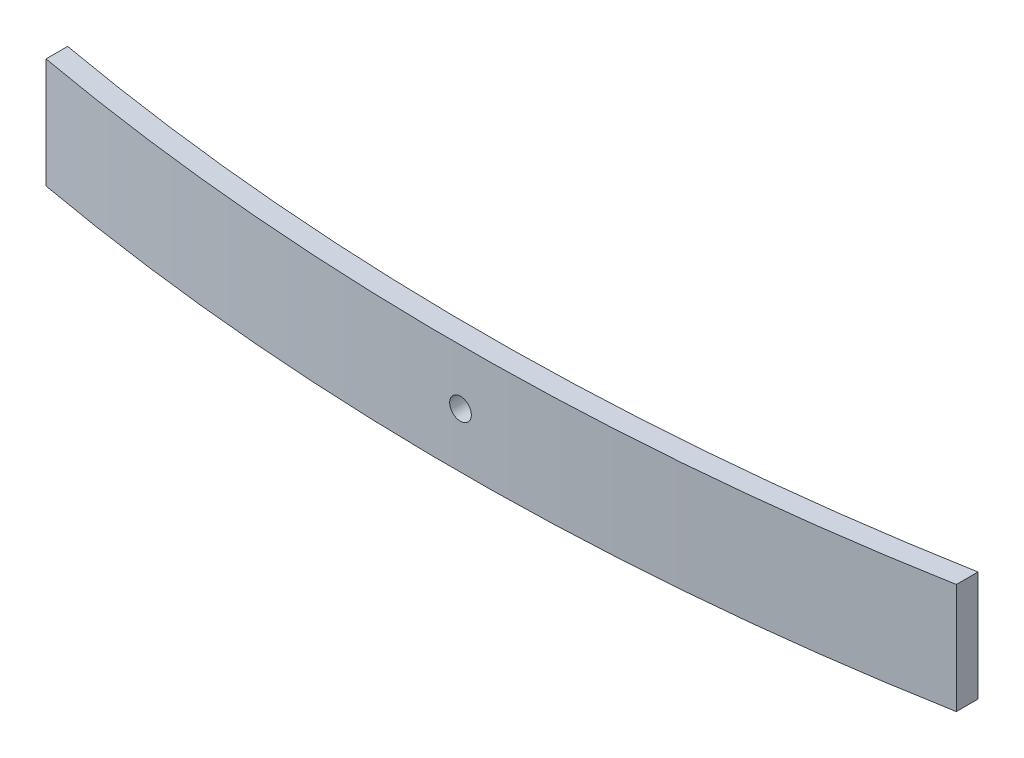
ISO-10303-21;
HEADER;
FILE_DESCRIPTION(('STEP AP214'),'2;1');
FILE_NAME('part.step','',(''),(''),'','','');
FILE_SCHEMA(('AUTOMOTIVE_DESIGN { 1 0 10303 214 1 1 1 1 }'));
ENDSEC;
DATA;
#1=APPLICATION_CONTEXT('core data for automotive mechanical design processes');
#2=APPLICATION_PROTOCOL_DEFINITION('international standard','automotive_design',2000,#1);
#3=PRODUCT_CONTEXT('',#1,'mechanical');
#4=PRODUCT('Part','Part','',(#3));
#5=PRODUCT_RELATED_PRODUCT_CATEGORY('part','',(#4));
#6=PRODUCT_DEFINITION_FORMATION('','',#4);
#7=PRODUCT_DEFINITION_CONTEXT('part definition',#1,'design');
#8=PRODUCT_DEFINITION('design','',#6,#7);
#9=PRODUCT_DEFINITION_SHAPE('','',#8);
#10=(LENGTH_UNIT() NAMED_UNIT(*) SI_UNIT(.MILLI.,.METRE.));
#11=(NAMED_UNIT(*) PLANE_ANGLE_UNIT() SI_UNIT($,.RADIAN.));
#12=(NAMED_UNIT(*) SI_UNIT($,.STERADIAN.) SOLID_ANGLE_UNIT());
#13=UNCERTAINTY_MEASURE_WITH_UNIT(LENGTH_MEASURE(1.E-05),#10,'distance_accuracy_value','');
#14=(GEOMETRIC_REPRESENTATION_CONTEXT(3) GLOBAL_UNCERTAINTY_ASSIGNED_CONTEXT((#13)) GLOBAL_UNIT_ASSIGNED_CONTEXT((#10,
#11,#12)) REPRESENTATION_CONTEXT('',''));
#15=CARTESIAN_POINT('',(0.,0.,0.));
#16=DIRECTION('',(0.,0.,1.));
#17=DIRECTION('',(1.,0.,0.));
#18=AXIS2_PLACEMENT_3D('',#15,#16,#17);
#19=CARTESIAN_POINT('',(1.7338276579252E-13,76.2,-1538.04997748712));
#20=DIRECTION('',(0.,-1.,0.));
#21=DIRECTION('',(0.,0.,-1.));
#22=AXIS2_PLACEMENT_3D('',#19,#20,#21);
#23=CYLINDRICAL_SURFACE('',#22,1776.04997748712);
#24=CARTESIAN_POINT('',(1.7338276579252E-13,0.,-1538.04997748712));
#25=DIRECTION('',(0.,1.,0.));
#26=DIRECTION('',(0.,0.,1.));
#27=AXIS2_PLACEMENT_3D('',#24,#25,#26);
#28=CIRCLE('',#27,1776.04997748712);
#29=CARTESIAN_POINT('',(315.021699517166,0.,209.838706429941));
#30=VERTEX_POINT('',#29);
#31=CARTESIAN_POINT('',(-315.021699517165,0.,209.838706429941));
#32=VERTEX_POINT('',#31);
#33=EDGE_CURVE('E122',#30,#32,#28,.F.);
#34=ORIENTED_EDGE('',*,*,#33,.F.);
#35=DIRECTION('',(0.,-1.,0.));
#36=VECTOR('',#35,1.);
#37=CARTESIAN_POINT('',(315.021699517166,76.2,209.838706429941));
#38=LINE('',#37,#36);
#39=CARTESIAN_POINT('',(315.021699517166,76.2,209.838706429941));
#40=VERTEX_POINT('',#39);
#41=EDGE_CURVE('E11',#40,#30,#38,.T.);
#42=ORIENTED_EDGE('',*,*,#41,.F.);
#43=CARTESIAN_POINT('',(1.7338276579252E-13,76.2,-1538.04997748712));
#44=DIRECTION('',(0.,1.,0.));
#45=DIRECTION('',(0.,0.,1.));
#46=AXIS2_PLACEMENT_3D('',#43,#44,#45);
#47=CIRCLE('',#46,1776.04997748712);
#48=CARTESIAN_POINT('',(-315.021699517165,76.2,209.838706429941));
#49=VERTEX_POINT('',#48);
#50=EDGE_CURVE('E115',#40,#49,#47,.F.);
#51=ORIENTED_EDGE('',*,*,#50,.T.);
#52=DIRECTION('',(0.,-1.,0.));
#53=VECTOR('',#52,1.);
#54=CARTESIAN_POINT('',(-315.021699517165,76.2,209.838706429941));
#55=LINE('',#54,#53);
#56=EDGE_CURVE('E94',#49,#32,#55,.T.);
#57=ORIENTED_EDGE('',*,*,#56,.T.);
#58=EDGE_LOOP('',(#34,#42,#51,#57));
#59=FACE_BOUND('',#58,.T.);
#60=CARTESIAN_POINT('',(1.7338276579252E-13,30.6,238.));
#61=CARTESIAN_POINT('',(-0.210713968094745,30.5999984867718,238.000000017793));
#62=CARTESIAN_POINT('',(-0.421403110930825,30.6088837241473,237.999962421727));
#63=CARTESIAN_POINT('',(-0.841354181845591,30.6443626478279,237.999813125687));
#64=CARTESIAN_POINT('',(-1.05061571988423,30.6709609920997,237.999701406219));
#65=CARTESIAN_POINT('',(-1.46633777348703,30.7417152082758,237.999406859924));
#66=CARTESIAN_POINT('',(-1.6727956251237,30.7858867143383,237.999223969782));
#67=CARTESIAN_POINT('',(-2.0813298290618,30.8914915499316,237.998792209093));
#68=CARTESIAN_POINT('',(-2.28340455125403,30.9529311869032,237.99854331444));
#69=CARTESIAN_POINT('',(-2.6815211011955,31.0925814227028,237.997986836868));
#70=CARTESIAN_POINT('',(-2.87756687230416,31.1707807807116,237.9976792933));
#71=CARTESIAN_POINT('',(-3.26237590887548,31.3434199132982,237.997014137911));
#72=CARTESIAN_POINT('',(-3.45113906456132,31.4378599325678,237.996656525334));
#73=CARTESIAN_POINT('',(-3.81998780496017,31.6422805388219,237.995901490769));
#74=CARTESIAN_POINT('',(-4.00007570143518,31.7522569546406,237.995504079473));
#75=CARTESIAN_POINT('',(-4.3503522252564,31.9869905222911,237.994680636077));
#76=CARTESIAN_POINT('',(-4.5205406230015,32.1117480167399,237.994254603313));
#77=CARTESIAN_POINT('',(-4.84979170206721,32.3751451316169,237.993386048449));
#78=CARTESIAN_POINT('',(-5.00885520931106,32.5137837196365,237.992943527577));
#79=CARTESIAN_POINT('',(-5.31479308067825,32.8040158599573,237.992054369382));
#80=CARTESIAN_POINT('',(-5.46166320475937,32.9556138817971,237.991607730686));
#81=CARTESIAN_POINT('',(-5.7420636270164,33.2705952098567,237.990723311728));
#82=CARTESIAN_POINT('',(-5.8755981564137,33.43397474943,237.990285528692));
#83=CARTESIAN_POINT('',(-6.12847828337047,33.771463069239,237.989430939818));
#84=CARTESIAN_POINT('',(-6.2478186237392,33.9455757887633,237.989014141785));
#85=CARTESIAN_POINT('',(-6.4713811147685,34.3032005309573,237.988213616073));
#86=CARTESIAN_POINT('',(-6.57560639321549,34.4867105983518,237.987829881558));
#87=CARTESIAN_POINT('',(-6.7682287591997,34.8618615632207,237.98710627353));
#88=CARTESIAN_POINT('',(-6.85662560065945,35.053502587046,237.986766400699));
#89=CARTESIAN_POINT('',(-7.01695887812283,35.443546097178,237.986140178144));
#90=CARTESIAN_POINT('',(-7.08889566823634,35.641948437921,237.985853827269));
#91=CARTESIAN_POINT('',(-7.21580133308613,36.0441127387919,237.985342762279));
#92=CARTESIAN_POINT('',(-7.27076981084061,36.2478748241926,237.985118049605));
#93=CARTESIAN_POINT('',(-7.36333699178477,36.659266525497,237.984736685148));
#94=CARTESIAN_POINT('',(-7.40093897454984,36.8668954034653,237.984580020515));
#95=CARTESIAN_POINT('',(-7.45853120590771,37.2846549482944,237.984339094535));
#96=CARTESIAN_POINT('',(-7.47851535225071,37.4947864564643,237.984254858275));
#97=CARTESIAN_POINT('',(-7.50070359679291,37.9159102543571,237.984161289859));
#98=CARTESIAN_POINT('',(-7.50291408330494,38.1269022075304,237.98415193079));
#99=CARTESIAN_POINT('',(-7.48955360463755,38.5484004665782,237.984208322118));
#100=CARTESIAN_POINT('',(-7.47397607404443,38.7589065643844,237.984274100247));
#101=CARTESIAN_POINT('',(-7.4251445256069,39.1778160268164,237.984478922777));
#102=CARTESIAN_POINT('',(-7.39189401428338,39.3862198002119,237.984617952642));
#103=CARTESIAN_POINT('',(-7.30795445093887,39.7994886750944,237.984965325868));
#104=CARTESIAN_POINT('',(-7.25726512758628,40.00435372147,237.985173670307));
#105=CARTESIAN_POINT('',(-7.13880941808652,40.4090816554473,237.985653753506));
#106=CARTESIAN_POINT('',(-7.07104334628324,40.6089446350511,237.985925491099));
#107=CARTESIAN_POINT('',(-6.91891409978094,41.0022558470402,237.986524655178));
#108=CARTESIAN_POINT('',(-6.83455053674628,41.1957039292107,237.986852082966));
#109=CARTESIAN_POINT('',(-6.64984230973389,41.5747716673122,237.987553267695));
#110=CARTESIAN_POINT('',(-6.54950055498257,41.7603927405777,237.9879270162));
#111=CARTESIAN_POINT('',(-6.33350673998435,42.1225834438659,237.988710406047));
#112=CARTESIAN_POINT('',(-6.21784939085651,42.2991499177425,237.989120059772));
#113=CARTESIAN_POINT('',(-5.97209494733971,42.6418601532707,237.989963414489));
#114=CARTESIAN_POINT('',(-5.8420030365321,42.8080076231484,237.990397106822));
#115=CARTESIAN_POINT('',(-5.5683051163473,43.1287715124287,237.99127634415));
#116=CARTESIAN_POINT('',(-5.42469413510151,43.2833836517498,237.991721893463));
#117=CARTESIAN_POINT('',(-4.97502421482194,43.7281685004763,237.993057195178));
#118=CARTESIAN_POINT('',(-4.64986305950492,43.9996590137956,237.993946551662));
#119=CARTESIAN_POINT('',(-4.13197567971231,44.3627081259288,237.995201923407));
#120=CARTESIAN_POINT('',(-3.95423770702114,44.4764002086073,237.99560743072));
#121=CARTESIAN_POINT('',(-3.5898090491096,44.6884506790732,237.996381434126));
#122=CARTESIAN_POINT('',(-3.40311815449513,44.7868087079934,237.996749929354));
#123=CARTESIAN_POINT('',(-2.83165300721101,45.0576661242204,237.99778332722));
#124=CARTESIAN_POINT('',(-2.4351711412674,45.2061693090257,237.998376934445));
#125=CARTESIAN_POINT('',(-1.62308827124564,45.434416916634,237.999304792558));
#126=CARTESIAN_POINT('',(-1.20748726904264,45.5141613461806,237.99963904347));
#127=CARTESIAN_POINT('',(-0.368800144783314,45.6027859953174,238.000011208188));
#128=CARTESIAN_POINT('',(0.0542859194178409,45.6116667624026,238.000049124282));
#129=CARTESIAN_POINT('',(0.896132618131227,45.5581931101371,237.999823726225));
#130=CARTESIAN_POINT('',(1.31489325255163,45.4958386892741,237.999560412067));
#131=CARTESIAN_POINT('',(1.9303436787739,45.350406625668,237.998962948761));
#132=CARTESIAN_POINT('',(2.1334669657178,45.2932419084603,237.998729895662));
#133=CARTESIAN_POINT('',(2.53416331768177,45.162045795966,237.998203357604));
#134=CARTESIAN_POINT('',(2.73173651249222,45.0880147954715,237.99790987406));
#135=CARTESIAN_POINT('',(3.31406084676332,44.8412313409882,237.996950242197));
#136=CARTESIAN_POINT('',(3.68878109502348,44.6437020734127,237.996204537467));
#137=CARTESIAN_POINT('',(4.22148178855392,44.302730393453,237.994991984489));
#138=CARTESIAN_POINT('',(4.39423732139198,44.1815494254651,237.99457188216));
#139=CARTESIAN_POINT('',(4.72893486876262,43.9250760102938,237.993712173886));
#140=CARTESIAN_POINT('',(4.89088085068091,43.7897887877032,237.993272575196));
#141=CARTESIAN_POINT('',(5.20283897410487,43.5060131269225,237.992386135607));
#142=CARTESIAN_POINT('',(5.35284682055934,43.3575199778821,237.99193929217));
#143=CARTESIAN_POINT('',(5.63977310900404,43.0484737070594,237.99105133538));
#144=CARTESIAN_POINT('',(5.77669606337008,42.8879247771161,237.990610220096));
#145=CARTESIAN_POINT('',(6.03655633591684,42.5558335361281,237.989746002998));
#146=CARTESIAN_POINT('',(6.15949097179766,42.3842891264945,237.989322904647));
#147=CARTESIAN_POINT('',(6.39046942201543,42.0314575902559,237.988506829959));
#148=CARTESIAN_POINT('',(6.4985135845827,41.8501706916277,237.988113852918));
#149=CARTESIAN_POINT('',(6.69894774113212,41.4791360457969,237.987369158747));
#150=CARTESIAN_POINT('',(6.79133744698065,41.2893881429433,237.987017442377));
#151=CARTESIAN_POINT('',(6.95980221242458,40.9027865931225,237.986365267456));
#152=CARTESIAN_POINT('',(7.03587752593888,40.7059330568037,237.986064808109));
#153=CARTESIAN_POINT('',(7.17118720449924,40.3064792017955,237.985523618733));
#154=CARTESIAN_POINT('',(7.23041839084983,40.1038778063369,237.985282899979));
#155=CARTESIAN_POINT('',(7.33158072491747,39.6944803968453,237.98486817799));
#156=CARTESIAN_POINT('',(7.37351824975524,39.4876859585834,237.984694150164));
#157=CARTESIAN_POINT('',(7.4398385898724,39.0712246263159,237.984417572837));
#158=CARTESIAN_POINT('',(7.46421508897784,38.8615567264141,237.984315049054));
#159=CARTESIAN_POINT('',(7.4952100559816,38.4409854893941,237.984184515178));
#160=CARTESIAN_POINT('',(7.50183466739309,38.2300826050054,237.984156479306));
#161=CARTESIAN_POINT('',(7.49729604901426,37.8084313167288,237.984175644232));
#162=CARTESIAN_POINT('',(7.48612970385174,37.5976829463634,237.984222858208));
#163=CARTESIAN_POINT('',(7.44608319144542,37.1778810074961,237.984391205324));
#164=CARTESIAN_POINT('',(7.41720343879285,36.9688273994434,237.984512336733));
#165=CARTESIAN_POINT('',(7.34193498439913,36.5538917028774,237.984825082016));
#166=CARTESIAN_POINT('',(7.29554590651514,36.3480096825963,237.985016697403));
#167=CARTESIAN_POINT('',(7.18558954382426,35.9408886735016,237.985464967259));
#168=CARTESIAN_POINT('',(7.1220225260479,35.7396496125661,237.985721620717));
#169=CARTESIAN_POINT('',(6.97814667319729,35.3431999543689,237.986292743016));
#170=CARTESIAN_POINT('',(6.89783430858542,35.1479906380154,237.986607224044));
#171=CARTESIAN_POINT('',(6.72107980430759,34.7651040508117,237.987284909401));
#172=CARTESIAN_POINT('',(6.62464362886645,34.5774240265767,237.987648095703));
#173=CARTESIAN_POINT('',(6.416272905285,34.2107950839367,237.988413096412));
#174=CARTESIAN_POINT('',(6.30433343128884,34.0318489650874,237.988814923082));
#175=CARTESIAN_POINT('',(6.06581689289911,33.6840847361217,237.989645553125));
#176=CARTESIAN_POINT('',(5.93924490882265,33.5152631415666,237.99007434711));
#177=CARTESIAN_POINT('',(5.67231991868902,33.1888660580893,237.990946907971));
#178=CARTESIAN_POINT('',(5.53196570521893,33.0312915565778,237.991390676156));
#179=CARTESIAN_POINT('',(5.23848659589206,32.7285285010307,237.992280544971));
#180=CARTESIAN_POINT('',(5.08536199605348,32.5833396600527,237.992726645546));
#181=CARTESIAN_POINT('',(4.76738488124476,32.3063385507568,237.993608647806));
#182=CARTESIAN_POINT('',(4.60252923302696,32.1745298791337,237.994044546725));
#183=CARTESIAN_POINT('',(4.26230143452241,31.9252727160435,237.994893638275));
#184=CARTESIAN_POINT('',(4.08692944268902,31.8078240082909,237.995306831249));
#185=CARTESIAN_POINT('',(3.72679224644607,31.5880456665329,237.996099052416));
#186=CARTESIAN_POINT('',(3.54202080718432,31.4857262486,237.996478057458));
#187=CARTESIAN_POINT('',(3.16457932589507,31.297064106327,237.997190684132));
#188=CARTESIAN_POINT('',(2.97191219636438,31.2107155544446,237.997524322307));
#189=CARTESIAN_POINT('',(2.58015719959567,31.0546324777027,237.998136625652));
#190=CARTESIAN_POINT('',(2.3810752055735,30.984883219795,237.998415339535));
#191=CARTESIAN_POINT('',(1.9778114443017,30.8624129523238,237.998910200255));
#192=CARTESIAN_POINT('',(1.77363103212915,30.8096874689385,237.999126363529));
#193=CARTESIAN_POINT('',(1.31020489979045,30.7106430274461,237.999535351372));
#194=CARTESIAN_POINT('',(1.04990557260774,30.6691871109607,237.99970896714));
#195=CARTESIAN_POINT('',(0.526391255000532,30.6138665423076,237.999941280342));
#196=CARTESIAN_POINT('',(0.263176264592653,30.6000018899827,237.999999977777));
#197=CARTESIAN_POINT('',(1.7338276579252E-13,30.6,238.));
#198=B_SPLINE_CURVE_WITH_KNOTS('',3,(#60,#61,#62,#63,#64,#65,#66,#67,#68,#69,#70,#71,#72,#73,
#74,#75,#76,#77,#78,#79,#80,#81,#82,#83,#84,#85,#86,#87,#88,#89,#90,#91,#92,#93,#94,#95,#96,#97,
#98,#99,#100,#101,#102,#103,#104,#105,#106,#107,#108,#109,#110,#111,#112,#113,#114,#115,#116,
#117,#118,#119,#120,#121,#122,#123,#124,#125,#126,#127,#128,#129,#130,#131,#132,#133,#134,#135,
#136,#137,#138,#139,#140,#141,#142,#143,#144,#145,#146,#147,#148,#149,#150,#151,#152,#153,#154,
#155,#156,#157,#158,#159,#160,#161,#162,#163,#164,#165,#166,#167,#168,#169,#170,#171,#172,#173,
#174,#175,#176,#177,#178,#179,#180,#181,#182,#183,#184,#185,#186,#187,#188,#189,#190,#191,#192,
#193,#194,#195,#196,#197),.UNSPECIFIED.,.T.,.F.,(4,2,2,2,2,2,2,2,2,2,2,2,2,2,2,2,2,2,2,2,2,2,2,
2,2,2,2,2,2,2,2,2,2,2,2,2,2,2,2,2,2,2,2,2,2,2,2,2,2,2,2,2,2,2,2,2,2,2,2,2,2,2,2,2,2,2,2,2,4),
(0.,0.631912024301777,1.2639902864152,1.89663214600144,2.52950538839113,3.16195548087539,
3.79441510307562,4.4267052459563,5.05901004782971,5.69126785680884,6.3237446098031,
6.95602004377836,7.58852893310258,8.22090674891289,8.85329439515874,9.48566843538515,
10.1180572691842,10.7503266306474,11.3828149038618,12.0150758342728,12.6475702025455,
13.2799391235442,13.9123178840565,14.5446850047721,15.177066922899,15.8093338315781,
16.4418196509556,17.0740790696136,17.7065719276866,18.9702098092056,19.602583667419,
20.2349723230349,21.4986105469059,22.7622486468442,24.0258769838608,25.2895053477042,
25.9218869189979,26.5542536895501,27.8178774792359,28.450372115571,29.0826333187677,
29.7151209754032,30.3473897231102,30.9797795065627,31.6121544983652,32.2445411283047,
32.8769179149983,33.5094139599539,34.1416765599364,34.7741664524213,35.4064374266601,
36.0388191299599,36.6711860326123,37.3035665208154,37.9359371792494,38.5684412619989,
39.2007118959496,39.8331838838019,40.4654369370645,41.097745429307,41.7300392686787,
42.3625026260201,42.9949564562123,43.6278354202829,44.2604829982539,44.892566944869,
45.5244846453389,46.3137263294984,47.1029680091572),.UNSPECIFIED.);
#199=CARTESIAN_POINT('',(1.7338276579252E-13,30.6,238.));
#200=VERTEX_POINT('',#199);
#201=EDGE_CURVE('E125',#200,#200,#198,.T.);
#202=ORIENTED_EDGE('',*,*,#201,.T.);
#203=EDGE_LOOP('',(#202));
#204=FACE_BOUND('',#203,.T.);
#205=ADVANCED_FACE('F49',(#59,#204),#23,.T.);
#206=CARTESIAN_POINT('',(5.59449830648205E-13,76.2,-1553.04997748711));
#207=DIRECTION('',(0.,-1.,0.));
#208=DIRECTION('',(0.,0.,-1.));
#209=AXIS2_PLACEMENT_3D('',#206,#207,#208);
#210=CYLINDRICAL_SURFACE('',#209,1776.04997748711);
#211=CARTESIAN_POINT('',(5.59449830648205E-13,0.,-1553.04997748711));
#212=DIRECTION('',(0.,1.,0.));
#213=DIRECTION('',(0.,0.,1.));
#214=AXIS2_PLACEMENT_3D('',#211,#212,#213);
#215=CIRCLE('',#214,1776.04997748711);
#216=CARTESIAN_POINT('',(315.021699517166,0.,194.838706429941));
#217=VERTEX_POINT('',#216);
#218=CARTESIAN_POINT('',(-315.021699517165,0.,194.838706429941));
#219=VERTEX_POINT('',#218);
#220=EDGE_CURVE('E87',#217,#219,#215,.F.);
#221=ORIENTED_EDGE('',*,*,#220,.T.);
#222=DIRECTION('',(0.,-1.,0.));
#223=VECTOR('',#222,1.);
#224=CARTESIAN_POINT('',(-315.021699517165,76.2,194.838706429941));
#225=LINE('',#224,#223);
#226=CARTESIAN_POINT('',(-315.021699517165,76.2,194.838706429941));
#227=VERTEX_POINT('',#226);
#228=EDGE_CURVE('E108',#227,#219,#225,.T.);
#229=ORIENTED_EDGE('',*,*,#228,.F.);
#230=CARTESIAN_POINT('',(5.59449830648205E-13,76.2,-1553.04997748711));
#231=DIRECTION('',(0.,1.,0.));
#232=DIRECTION('',(0.,0.,1.));
#233=AXIS2_PLACEMENT_3D('',#230,#231,#232);
#234=CIRCLE('',#233,1776.04997748711);
#235=CARTESIAN_POINT('',(315.021699517166,76.2,194.838706429941));
#236=VERTEX_POINT('',#235);
#237=EDGE_CURVE('E110',#236,#227,#234,.F.);
#238=ORIENTED_EDGE('',*,*,#237,.F.);
#239=DIRECTION('',(0.,-1.,0.));
#240=VECTOR('',#239,1.);
#241=CARTESIAN_POINT('',(315.021699517166,76.2,194.838706429941));
#242=LINE('',#241,#240);
#243=EDGE_CURVE('E64',#236,#217,#242,.T.);
#244=ORIENTED_EDGE('',*,*,#243,.T.);
#245=EDGE_LOOP('',(#221,#229,#238,#244));
#246=FACE_BOUND('',#245,.T.);
#247=CARTESIAN_POINT('',(-7.5,38.1,222.984164226377));
#248=CARTESIAN_POINT('',(-7.50000151322819,38.3107139680855,222.984164208572));
#249=CARTESIAN_POINT('',(-7.49111627585349,38.5214031109122,222.984201804954));
#250=CARTESIAN_POINT('',(-7.45563735217615,38.9413541818078,222.984351102375));
#251=CARTESIAN_POINT('',(-7.42903900790671,39.1506157198367,222.984462822905));
#252=CARTESIAN_POINT('',(-7.35828479173724,39.56633777342,222.984757371678));
#253=CARTESIAN_POINT('',(-7.31411328567894,39.7727956250468,222.984940263235));
#254=CARTESIAN_POINT('',(-7.208508450096,40.181329828965,222.985372027226));
#255=CARTESIAN_POINT('',(-7.14706881313061,40.3834045511471,222.985620923766));
#256=CARTESIAN_POINT('',(-7.00741857734594,40.781521101067,222.98617740523));
#257=CARTESIAN_POINT('',(-6.92921921934608,40.9775668721644,222.986484950802));
#258=CARTESIAN_POINT('',(-6.75658008677936,41.362375908714,222.987150110131));
#259=CARTESIAN_POINT('',(-6.66214006752075,41.5511390643896,222.987507724643));
#260=CARTESIAN_POINT('',(-6.45771946129041,41.9199878047696,222.988262762777));
#261=CARTESIAN_POINT('',(-6.34774304548433,42.1000757012362,222.988660175705));
#262=CARTESIAN_POINT('',(-6.11300947786034,42.4503522250429,222.989483621892));
#263=CARTESIAN_POINT('',(-5.98825198342546,42.6205406227819,222.989909655814));
#264=CARTESIAN_POINT('',(-5.72485486856214,42.9497917018563,222.990778212374));
#265=CARTESIAN_POINT('',(-5.5862162805409,43.1088552091137,222.991220733785));
#266=CARTESIAN_POINT('',(-5.29598414021394,43.414793080508,222.992109892413));
#267=CARTESIAN_POINT('',(-5.14438611836975,43.5616632046028,222.992556531002));
#268=CARTESIAN_POINT('',(-4.82940479029846,43.8420636268864,222.993440949047));
#269=CARTESIAN_POINT('',(-4.66602525071789,43.9755981562967,222.993878731278));
#270=CARTESIAN_POINT('',(-4.32853693089198,44.2284782832785,222.994733317997));
#271=CARTESIAN_POINT('',(-4.1544242113579,44.3478186236592,222.99515011468));
#272=CARTESIAN_POINT('',(-3.79679946915636,44.5713811147018,222.995950637268));
#273=CARTESIAN_POINT('',(-3.61328940176486,44.6756063931513,222.996334370008));
#274=CARTESIAN_POINT('',(-3.23813843690195,44.868228759141,222.997057974285));
#275=CARTESIAN_POINT('',(-3.04649741307954,44.9566256006036,222.99739784514));
#276=CARTESIAN_POINT('',(-2.65645390295347,45.116958878073,222.998024063725));
#277=CARTESIAN_POINT('',(-2.4580515622135,45.1888956681897,222.998310412606));
#278=CARTESIAN_POINT('',(-2.05588726134914,45.3158013330459,222.998821473858));
#279=CARTESIAN_POINT('',(-1.85212517595196,45.3707698108037,222.999046184785));
#280=CARTESIAN_POINT('',(-1.44073347465677,45.4633369917546,222.999427546169));
#281=CARTESIAN_POINT('',(-1.23310459669404,45.5009389745232,222.999584209476));
#282=CARTESIAN_POINT('',(-0.815345051876461,45.5585312058889,222.999825133398));
#283=CARTESIAN_POINT('',(-0.60521354371259,45.5785153522362,222.999909368927));
#284=CARTESIAN_POINT('',(-0.184089745831488,45.6007035967881,223.000002936514));
#285=CARTESIAN_POINT('',(0.0269022073360887,45.6029140833055,223.000012295484));
#286=CARTESIAN_POINT('',(0.448400466373133,45.5895536046497,222.999955904648));
#287=CARTESIAN_POINT('',(0.658906564174363,45.5739760740628,222.999890127109));
#288=CARTESIAN_POINT('',(1.07781602663255,45.5251445256344,222.999685306357));
#289=CARTESIAN_POINT('',(1.28621980005893,45.4918940143109,222.999546277678));
#290=CARTESIAN_POINT('',(1.6994886750032,45.407954450961,222.999198907314));
#291=CARTESIAN_POINT('',(1.90435372140974,45.357265127603,222.998990564549));
#292=CARTESIAN_POINT('',(2.30908165544806,45.2388094180872,222.998510484954));
#293=CARTESIAN_POINT('',(2.50894463508202,45.1710433462732,222.998238749291));
#294=CARTESIAN_POINT('',(2.90225584712974,45.0189140997444,222.997639589155));
#295=CARTESIAN_POINT('',(3.09570392932877,44.9345505366938,222.997312163378));
#296=CARTESIAN_POINT('',(3.47477166746599,44.7498423096539,222.996610982501));
#297=CARTESIAN_POINT('',(3.66039274073949,44.6495005548925,222.996237235837));
#298=CARTESIAN_POINT('',(4.02258344404181,44.433506739873,222.99545384932));
#299=CARTESIAN_POINT('',(4.1991499179246,44.3178493907339,222.995044197084));
#300=CARTESIAN_POINT('',(4.5418601534629,44.0720949471939,222.994200844778));
#301=CARTESIAN_POINT('',(4.70800762334451,43.9420030363744,222.99376715337));
#302=CARTESIAN_POINT('',(5.02877151263006,43.6683051161658,222.992887917265));
#303=CARTESIAN_POINT('',(5.18338365195257,43.524694134908,222.992442368252));
#304=CARTESIAN_POINT('',(5.62816850065028,43.075024214623,222.991107066409));
#305=CARTESIAN_POINT('',(5.89965901394052,42.7498630593184,222.990217708469));
#306=CARTESIAN_POINT('',(6.26270812603403,42.231975679552,222.988962332908));
#307=CARTESIAN_POINT('',(6.37640020870003,42.0542377068708,222.988556824049));
#308=CARTESIAN_POINT('',(6.58845067914274,41.689809048981,222.987782817221));
#309=CARTESIAN_POINT('',(6.68680870805226,41.5031181543784,222.987414320118));
#310=CARTESIAN_POINT('',(6.95766612427186,40.9316530070874,222.986380916429));
#311=CARTESIAN_POINT('',(7.1061693090764,40.5351711411231,222.985787305057));
#312=CARTESIAN_POINT('',(7.33441691667697,39.7230882710565,222.98485943989));
#313=CARTESIAN_POINT('',(7.4141613462167,39.3074872688294,222.98452518607));
#314=CARTESIAN_POINT('',(7.50278599532745,38.4688001445599,222.98415301811));
#315=CARTESIAN_POINT('',(7.51166676240021,38.0457140803735,222.984115101681));
#316=CARTESIAN_POINT('',(7.45819311011506,37.2038673816925,222.984340501734));
#317=CARTESIAN_POINT('',(7.39583868924482,36.7851067472898,222.984603818222));
#318=CARTESIAN_POINT('',(7.25040662563846,36.1696563211186,222.985201286275));
#319=CARTESIAN_POINT('',(7.19324190843678,35.9665330342062,222.985434341166));
#320=CARTESIAN_POINT('',(7.06204579596008,35.5658366823044,222.98596088302));
#321=CARTESIAN_POINT('',(6.988014795477,35.3682634875246,222.986254368569));
#322=CARTESIAN_POINT('',(6.74123134103598,34.7859391533421,222.987214006388));
#323=CARTESIAN_POINT('',(6.54370207349932,34.4112189051374,222.987959715013));
#324=CARTESIAN_POINT('',(6.20273039359089,33.8785182116486,222.98917227251));
#325=CARTESIAN_POINT('',(6.08154942560717,33.7057626788045,222.989592376125));
#326=CARTESIAN_POINT('',(5.82507601044284,33.3710651314208,222.990452086404));
#327=CARTESIAN_POINT('',(5.68978878785503,33.2091191494955,222.990891685812));
#328=CARTESIAN_POINT('',(5.40601312707813,32.8971610260567,222.991778126147));
#329=CARTESIAN_POINT('',(5.25751997803879,32.7471531795944,222.992224969611));
#330=CARTESIAN_POINT('',(4.9484737072162,32.4602268911334,222.993112925805));
#331=CARTESIAN_POINT('',(4.78792477727201,32.3233039367589,222.993554040465));
#332=CARTESIAN_POINT('',(4.45583353628019,32.0634436641952,222.994418255711));
#333=CARTESIAN_POINT('',(4.28428912664369,31.9405090283058,222.994841352832));
#334=CARTESIAN_POINT('',(3.93145759039771,31.7095305780716,222.995657424618));
#335=CARTESIAN_POINT('',(3.75017069176505,31.6014864154963,222.996050399989));
#336=CARTESIAN_POINT('',(3.37913604592412,31.4010522589318,222.99679509052));
#337=CARTESIAN_POINT('',(3.18938814306503,31.3086625530763,222.997146804922));
#338=CARTESIAN_POINT('',(2.80278659323259,31.1401977876195,222.997798975874));
#339=CARTESIAN_POINT('',(2.60593305690779,31.0641224740995,222.998099433222));
#340=CARTESIAN_POINT('',(2.20647920190446,30.9288127955346,222.998640618766));
#341=CARTESIAN_POINT('',(2.00387780645708,30.8695816091838,222.998881335688));
#342=CARTESIAN_POINT('',(1.59448039698905,30.7684192751141,222.999296054415));
#343=CARTESIAN_POINT('',(1.38768595873948,30.7264817502745,222.999470080811));
#344=CARTESIAN_POINT('',(0.971224626496983,30.6601614101516,222.999746655794));
#345=CARTESIAN_POINT('',(0.761556726607803,30.6357849110423,222.999849178663));
#346=CARTESIAN_POINT('',(0.340985489613211,30.6047899440287,222.999979711378));
#347=CARTESIAN_POINT('',(0.130082605237186,30.5981653326113,223.000007747002));
#348=CARTESIAN_POINT('',(-0.291568683048696,30.6027039509765,222.999988582247));
#349=CARTESIAN_POINT('',(-0.502317053436053,30.6138702961342,222.99994136869));
#350=CARTESIAN_POINT('',(-0.922118992347877,30.6539168085346,222.999773023057));
#351=CARTESIAN_POINT('',(-1.13117260042308,30.6827965611862,222.99965189271));
#352=CARTESIAN_POINT('',(-1.54610829703442,30.7580650155817,222.999339150039));
#353=CARTESIAN_POINT('',(-1.75199031733826,30.8044540934685,222.9991475362));
#354=CARTESIAN_POINT('',(-2.15911132647841,30.9144104561691,222.998699269789));
#355=CARTESIAN_POINT('',(-2.36035038743661,30.9779774739523,222.998442618228));
#356=CARTESIAN_POINT('',(-2.75680004567822,31.1218533268206,222.997871499834));
#357=CARTESIAN_POINT('',(-2.95200936205342,31.2021656914433,222.997557020813));
#358=CARTESIAN_POINT('',(-3.33489594929876,31.3789201957465,222.99687933939));
#359=CARTESIAN_POINT('',(-3.52257597355381,31.4753563712022,222.996516155014));
#360=CARTESIAN_POINT('',(-3.88920491623113,31.6837270948159,222.995751157796));
#361=CARTESIAN_POINT('',(-4.06815103509761,31.7956665688298,222.995349332689));
#362=CARTESIAN_POINT('',(-4.41591526409443,32.0341831072574,222.994518705298));
#363=CARTESIAN_POINT('',(-4.58473685866346,32.1607550913541,222.994089912401));
#364=CARTESIAN_POINT('',(-4.91113394213839,32.4276800815085,222.993217353088));
#365=CARTESIAN_POINT('',(-5.0687084436356,32.568034294977,222.992773585362));
#366=CARTESIAN_POINT('',(-5.37147149915388,32.8615134042977,222.991883716796));
#367=CARTESIAN_POINT('',(-5.51666034011746,33.0146380041317,222.991437616009));
#368=CARTESIAN_POINT('',(-5.79366144938521,33.3326151189285,222.99055561267));
#369=CARTESIAN_POINT('',(-5.9254701209946,33.4974707671389,222.990119712884));
#370=CARTESIAN_POINT('',(-6.17472728405847,33.8376985656261,222.989270619055));
#371=CARTESIAN_POINT('',(-6.29217599179848,34.0130705574494,222.988857424669));
#372=CARTESIAN_POINT('',(-6.51195433354261,34.3732077536857,222.988065200255));
#373=CARTESIAN_POINT('',(-6.61427375147285,34.5579791929515,222.987686193377));
#374=CARTESIAN_POINT('',(-6.80293589374009,34.935420674249,222.986973562955));
#375=CARTESIAN_POINT('',(-6.88928444561939,35.1280878037838,222.986639922868));
#376=CARTESIAN_POINT('',(-7.04536752235469,35.5198428005607,222.98602761556));
#377=CARTESIAN_POINT('',(-7.11511678025874,35.7189247945869,222.985748899626));
#378=CARTESIAN_POINT('',(-7.23758704772251,36.1221885558675,222.985254035172));
#379=CARTESIAN_POINT('',(-7.29031253110391,36.3263689680447,222.985037870214));
#380=CARTESIAN_POINT('',(-7.38935697257925,36.789795100359,222.984628879072));
#381=CARTESIAN_POINT('',(-7.43081288905515,37.0500944275119,222.984455261811));
#382=CARTESIAN_POINT('',(-7.48613345769553,37.5736087450595,222.984222946583));
#383=CARTESIAN_POINT('',(-7.49999811001735,37.8368237354374,222.984164248617));
#384=CARTESIAN_POINT('',(-7.5,38.1,222.984164226377));
#385=B_SPLINE_CURVE_WITH_KNOTS('',3,(#247,#248,#249,#250,#251,#252,#253,#254,#255,#256,#257,
#258,#259,#260,#261,#262,#263,#264,#265,#266,#267,#268,#269,#270,#271,#272,#273,#274,#275,#276,
#277,#278,#279,#280,#281,#282,#283,#284,#285,#286,#287,#288,#289,#290,#291,#292,#293,#294,#295,
#296,#297,#298,#299,#300,#301,#302,#303,#304,#305,#306,#307,#308,#309,#310,#311,#312,#313,#314,
#315,#316,#317,#318,#319,#320,#321,#322,#323,#324,#325,#326,#327,#328,#329,#330,#331,#332,#333,
#334,#335,#336,#337,#338,#339,#340,#341,#342,#343,#344,#345,#346,#347,#348,#349,#350,#351,#352,
#353,#354,#355,#356,#357,#358,#359,#360,#361,#362,#363,#364,#365,#366,#367,#368,#369,#370,#371,
#372,#373,#374,#375,#376,#377,#378,#379,#380,#381,#382,#383,#384),.UNSPECIFIED.,.T.,.F.,(4,2,2,
2,2,2,2,2,2,2,2,2,2,2,2,2,2,2,2,2,2,2,2,2,2,2,2,2,2,2,2,2,2,2,2,2,2,2,2,2,2,2,2,2,2,2,2,2,2,2,2,
2,2,2,2,2,2,2,2,2,2,2,2,2,2,2,2,2,4),(0.,0.631912024273445,1.26399028635863,1.8966321459171,
2.52950538827903,3.16195548073078,3.79441510289855,4.4267052457472,5.05901004758861,
5.69126785660491,6.32374460963635,6.95602004364787,7.58852893300834,8.22090674880477,
8.85329439503677,9.48566843524987,10.1180572690357,10.7503266304816,11.3828149036786,
12.015075834073,12.6475702023291,13.2799391234167,13.9123178840178,14.5446850048214,
15.1770669230362,15.8093338317406,16.4418196511433,17.0740790698267,17.7065719279251,
18.9702098093707,19.6025836675478,20.2349723231275,21.4986105470723,22.7622486470823,
24.0258769840529,25.2895053478503,25.9218869190543,26.554253689517,27.8178774790259,
28.4503721153762,29.0826333185882,29.7151209752384,30.3473897229599,30.9797795064268,
31.6121544982437,32.2445411281974,32.8769179149054,33.5094139598227,34.1416765597668,
34.7741664522143,35.4064374264159,36.0388191297804,36.6711860324975,37.3035665207648,
37.9359371792628,38.5684412620756,39.2007118960893,39.8331838840045,40.4654369373297,
41.0977454295341,41.7300392688676,42.3625026261715,42.9949564563263,43.6278354204137,
44.2604829984013,44.8925669450324,45.524484645518,46.313726329588,47.1029680091571),.UNSPECIFIED.);
#386=CARTESIAN_POINT('',(-7.5,38.1,222.984164226377));
#387=VERTEX_POINT('',#386);
#388=EDGE_CURVE('E53',#387,#387,#385,.T.);
#389=ORIENTED_EDGE('',*,*,#388,.F.);
#390=EDGE_LOOP('',(#389));
#391=FACE_BOUND('',#390,.T.);
#392=ADVANCED_FACE('F111',(#246,#391),#210,.F.);
#393=CARTESIAN_POINT('',(315.021699517165,76.2,-1.16581448020168E-12));
#394=DIRECTION('',(1.,0.,0.));
#395=DIRECTION('',(0.,0.,-1.));
#396=AXIS2_PLACEMENT_3D('',#393,#394,#395);
#397=PLANE('',#396);
#398=DIRECTION('',(0.,0.,1.));
#399=VECTOR('',#398,1.);
#400=CARTESIAN_POINT('',(315.021699517165,0.,-1.16581448020168E-12));
#401=LINE('',#400,#399);
#402=EDGE_CURVE('E107',#217,#30,#401,.T.);
#403=ORIENTED_EDGE('',*,*,#402,.F.);
#404=ORIENTED_EDGE('',*,*,#243,.F.);
#405=DIRECTION('',(0.,0.,1.));
#406=VECTOR('',#405,1.);
#407=CARTESIAN_POINT('',(315.021699517165,76.2,-1.16581448020168E-12));
#408=LINE('',#407,#406);
#409=EDGE_CURVE('E105',#236,#40,#408,.T.);
#410=ORIENTED_EDGE('',*,*,#409,.T.);
#411=ORIENTED_EDGE('',*,*,#41,.T.);
#412=EDGE_LOOP('',(#403,#404,#410,#411));
#413=FACE_BOUND('',#412,.T.);
#414=ADVANCED_FACE('F103',(#413),#397,.T.);
#415=CARTESIAN_POINT('',(-315.021699517165,76.2,0.));
#416=DIRECTION('',(1.,0.,0.));
#417=DIRECTION('',(0.,0.,-1.));
#418=AXIS2_PLACEMENT_3D('',#415,#416,#417);
#419=PLANE('',#418);
#420=DIRECTION('',(0.,0.,1.));
#421=VECTOR('',#420,1.);
#422=CARTESIAN_POINT('',(-315.021699517165,0.,0.));
#423=LINE('',#422,#421);
#424=EDGE_CURVE('E117',#219,#32,#423,.T.);
#425=ORIENTED_EDGE('',*,*,#424,.T.);
#426=ORIENTED_EDGE('',*,*,#56,.F.);
#427=DIRECTION('',(0.,0.,1.));
#428=VECTOR('',#427,1.);
#429=CARTESIAN_POINT('',(-315.021699517165,76.2,0.));
#430=LINE('',#429,#428);
#431=EDGE_CURVE('E72',#227,#49,#430,.T.);
#432=ORIENTED_EDGE('',*,*,#431,.F.);
#433=ORIENTED_EDGE('',*,*,#228,.T.);
#434=EDGE_LOOP('',(#425,#426,#432,#433));
#435=FACE_BOUND('',#434,.T.);
#436=ADVANCED_FACE('F132',(#435),#419,.F.);
#437=CARTESIAN_POINT('',(0.,76.2,0.));
#438=DIRECTION('',(0.,1.,0.));
#439=DIRECTION('',(0.,0.,1.));
#440=AXIS2_PLACEMENT_3D('',#437,#438,#439);
#441=PLANE('',#440);
#442=ORIENTED_EDGE('',*,*,#50,.F.);
#443=ORIENTED_EDGE('',*,*,#409,.F.);
#444=ORIENTED_EDGE('',*,*,#237,.T.);
#445=ORIENTED_EDGE('',*,*,#431,.T.);
#446=EDGE_LOOP('',(#442,#443,#444,#445));
#447=FACE_BOUND('',#446,.T.);
#448=ADVANCED_FACE('F114',(#447),#441,.T.);
#449=CARTESIAN_POINT('',(0.,0.,0.));
#450=DIRECTION('',(0.,1.,0.));
#451=DIRECTION('',(0.,0.,1.));
#452=AXIS2_PLACEMENT_3D('',#449,#450,#451);
#453=PLANE('',#452);
#454=ORIENTED_EDGE('',*,*,#33,.T.);
#455=ORIENTED_EDGE('',*,*,#424,.F.);
#456=ORIENTED_EDGE('',*,*,#220,.F.);
#457=ORIENTED_EDGE('',*,*,#402,.T.);
#458=EDGE_LOOP('',(#454,#455,#456,#457));
#459=FACE_BOUND('',#458,.T.);
#460=ADVANCED_FACE('F134',(#459),#453,.F.);
#461=CARTESIAN_POINT('',(0.,38.1,238.));
#462=DIRECTION('',(0.,0.,-1.));
#463=DIRECTION('',(-1.,0.,0.));
#464=AXIS2_PLACEMENT_3D('',#461,#462,#463);
#465=CYLINDRICAL_SURFACE('',#464,7.5);
#466=ORIENTED_EDGE('',*,*,#201,.F.);
#467=EDGE_LOOP('',(#466));
#468=FACE_BOUND('',#467,.T.);
#469=ORIENTED_EDGE('',*,*,#388,.T.);
#470=EDGE_LOOP('',(#469));
#471=FACE_BOUND('',#470,.T.);
#472=ADVANCED_FACE('F144',(#468,#471),#465,.F.);
#473=CLOSED_SHELL('',(#205,#392,#414,#436,#448,#460,#472));
#474=MANIFOLD_SOLID_BREP('B2',#473);
#475=ADVANCED_BREP_SHAPE_REPRESENTATION('',(#18,#474),#14);
#476=SHAPE_DEFINITION_REPRESENTATION(#9,#475);
ENDSEC;
END-ISO-10303-21;
